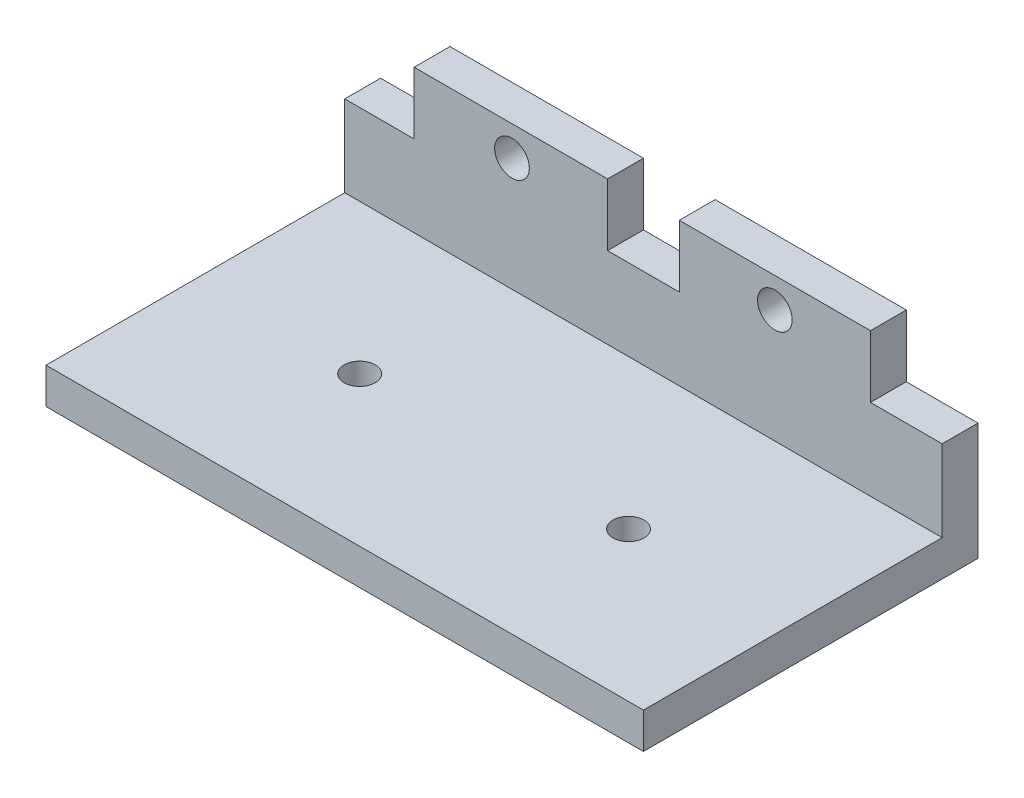
ISO-10303-21;
HEADER;
FILE_DESCRIPTION(('STEP AP214'),'2;1');
FILE_NAME('part.step','',(''),(''),'','','');
FILE_SCHEMA(('AUTOMOTIVE_DESIGN { 1 0 10303 214 1 1 1 1 }'));
ENDSEC;
DATA;
#1=APPLICATION_CONTEXT('core data for automotive mechanical design processes');
#2=APPLICATION_PROTOCOL_DEFINITION('international standard','automotive_design',2000,#1);
#3=PRODUCT_CONTEXT('',#1,'mechanical');
#4=PRODUCT('Part','Part','',(#3));
#5=PRODUCT_RELATED_PRODUCT_CATEGORY('part','',(#4));
#6=PRODUCT_DEFINITION_FORMATION('','',#4);
#7=PRODUCT_DEFINITION_CONTEXT('part definition',#1,'design');
#8=PRODUCT_DEFINITION('design','',#6,#7);
#9=PRODUCT_DEFINITION_SHAPE('','',#8);
#10=(LENGTH_UNIT() NAMED_UNIT(*) SI_UNIT(.MILLI.,.METRE.));
#11=(NAMED_UNIT(*) PLANE_ANGLE_UNIT() SI_UNIT($,.RADIAN.));
#12=(NAMED_UNIT(*) SI_UNIT($,.STERADIAN.) SOLID_ANGLE_UNIT());
#13=UNCERTAINTY_MEASURE_WITH_UNIT(LENGTH_MEASURE(1.E-05),#10,'distance_accuracy_value','');
#14=(GEOMETRIC_REPRESENTATION_CONTEXT(3) GLOBAL_UNCERTAINTY_ASSIGNED_CONTEXT((#13)) GLOBAL_UNIT_ASSIGNED_CONTEXT((#10,
#11,#12)) REPRESENTATION_CONTEXT('',''));
#15=CARTESIAN_POINT('',(0.,0.,0.));
#16=DIRECTION('',(0.,0.,1.));
#17=DIRECTION('',(1.,0.,0.));
#18=AXIS2_PLACEMENT_3D('',#15,#16,#17);
#19=CARTESIAN_POINT('',(0.,15.,0.));
#20=DIRECTION('',(0.,1.,0.));
#21=DIRECTION('',(0.,0.,1.));
#22=AXIS2_PLACEMENT_3D('',#19,#20,#21);
#23=PLANE('',#22);
#24=DIRECTION('',(0.,0.,-1.));
#25=VECTOR('',#24,1.);
#26=CARTESIAN_POINT('',(19.,15.,-11.));
#27=LINE('',#26,#25);
#28=CARTESIAN_POINT('',(19.,15.,-11.));
#29=VERTEX_POINT('',#28);
#30=CARTESIAN_POINT('',(19.,15.,-14.));
#31=VERTEX_POINT('',#30);
#32=EDGE_CURVE('E259',#29,#31,#27,.T.);
#33=ORIENTED_EDGE('',*,*,#32,.T.);
#34=DIRECTION('',(-1.,0.,0.));
#35=VECTOR('',#34,1.);
#36=CARTESIAN_POINT('',(-25.,15.,-14.));
#37=LINE('',#36,#35);
#38=CARTESIAN_POINT('',(3.,15.,-14.));
#39=VERTEX_POINT('',#38);
#40=EDGE_CURVE('E173',#31,#39,#37,.T.);
#41=ORIENTED_EDGE('',*,*,#40,.T.);
#42=DIRECTION('',(0.,0.,-1.));
#43=VECTOR('',#42,1.);
#44=CARTESIAN_POINT('',(3.,15.,-11.));
#45=LINE('',#44,#43);
#46=CARTESIAN_POINT('',(3.,15.,-11.));
#47=VERTEX_POINT('',#46);
#48=EDGE_CURVE('E300',#47,#39,#45,.T.);
#49=ORIENTED_EDGE('',*,*,#48,.F.);
#50=DIRECTION('',(1.,0.,0.));
#51=VECTOR('',#50,1.);
#52=CARTESIAN_POINT('',(-25.,15.,-11.));
#53=LINE('',#52,#51);
#54=EDGE_CURVE('E260',#47,#29,#53,.T.);
#55=ORIENTED_EDGE('',*,*,#54,.T.);
#56=EDGE_LOOP('',(#33,#41,#49,#55));
#57=FACE_BOUND('',#56,.T.);
#58=ADVANCED_FACE('F45',(#57),#23,.T.);
#59=CARTESIAN_POINT('',(25.,3.,-14.));
#60=DIRECTION('',(-1.,0.,0.));
#61=DIRECTION('',(0.,0.,1.));
#62=AXIS2_PLACEMENT_3D('',#59,#60,#61);
#63=PLANE('',#62);
#64=DIRECTION('',(0.,-1.,0.));
#65=VECTOR('',#64,1.);
#66=CARTESIAN_POINT('',(25.,3.,-14.));
#67=LINE('',#66,#65);
#68=CARTESIAN_POINT('',(25.,9.8,-14.));
#69=VERTEX_POINT('',#68);
#70=CARTESIAN_POINT('',(25.,0.,-14.));
#71=VERTEX_POINT('',#70);
#72=EDGE_CURVE('E11',#69,#71,#67,.T.);
#73=ORIENTED_EDGE('',*,*,#72,.F.);
#74=DIRECTION('',(0.,0.,-1.));
#75=VECTOR('',#74,1.);
#76=CARTESIAN_POINT('',(25.,9.8,-11.));
#77=LINE('',#76,#75);
#78=CARTESIAN_POINT('',(25.,9.8,-11.));
#79=VERTEX_POINT('',#78);
#80=EDGE_CURVE('E149',#79,#69,#77,.T.);
#81=ORIENTED_EDGE('',*,*,#80,.F.);
#82=DIRECTION('',(0.,-1.,0.));
#83=VECTOR('',#82,1.);
#84=CARTESIAN_POINT('',(25.,15.,-11.));
#85=LINE('',#84,#83);
#86=CARTESIAN_POINT('',(25.,3.,-11.));
#87=VERTEX_POINT('',#86);
#88=EDGE_CURVE('E162',#79,#87,#85,.T.);
#89=ORIENTED_EDGE('',*,*,#88,.T.);
#90=DIRECTION('',(0.,0.,-1.));
#91=VECTOR('',#90,1.);
#92=CARTESIAN_POINT('',(25.,3.,-14.));
#93=LINE('',#92,#91);
#94=CARTESIAN_POINT('',(25.,3.,14.));
#95=VERTEX_POINT('',#94);
#96=EDGE_CURVE('E184',#95,#87,#93,.T.);
#97=ORIENTED_EDGE('',*,*,#96,.F.);
#98=DIRECTION('',(0.,-1.,0.));
#99=VECTOR('',#98,1.);
#100=CARTESIAN_POINT('',(25.,3.,14.));
#101=LINE('',#100,#99);
#102=CARTESIAN_POINT('',(25.,0.,14.));
#103=VERTEX_POINT('',#102);
#104=EDGE_CURVE('E194',#95,#103,#101,.T.);
#105=ORIENTED_EDGE('',*,*,#104,.T.);
#106=DIRECTION('',(0.,0.,-1.));
#107=VECTOR('',#106,1.);
#108=CARTESIAN_POINT('',(25.,0.,-14.));
#109=LINE('',#108,#107);
#110=EDGE_CURVE('E177',#103,#71,#109,.T.);
#111=ORIENTED_EDGE('',*,*,#110,.T.);
#112=EDGE_LOOP('',(#73,#81,#89,#97,#105,#111));
#113=FACE_BOUND('',#112,.T.);
#114=ADVANCED_FACE('F47',(#113),#63,.F.);
#115=CARTESIAN_POINT('',(-25.,3.,-14.));
#116=DIRECTION('',(0.,0.,1.));
#117=DIRECTION('',(1.,0.,0.));
#118=AXIS2_PLACEMENT_3D('',#115,#116,#117);
#119=PLANE('',#118);
#120=CARTESIAN_POINT('',(11.,12.5,-14.));
#121=DIRECTION('',(0.,0.,-1.));
#122=DIRECTION('',(-1.,0.,0.));
#123=AXIS2_PLACEMENT_3D('',#120,#121,#122);
#124=CIRCLE('',#123,1.45);
#125=CARTESIAN_POINT('',(9.55,12.5,-14.));
#126=VERTEX_POINT('',#125);
#127=EDGE_CURVE('E387',#126,#126,#124,.T.);
#128=ORIENTED_EDGE('',*,*,#127,.F.);
#129=EDGE_LOOP('',(#128));
#130=FACE_BOUND('',#129,.T.);
#131=CARTESIAN_POINT('',(-11.,12.5,-14.));
#132=DIRECTION('',(0.,0.,-1.));
#133=DIRECTION('',(1.,0.,0.));
#134=AXIS2_PLACEMENT_3D('',#131,#132,#133);
#135=CIRCLE('',#134,1.45);
#136=CARTESIAN_POINT('',(-9.55,12.5,-14.));
#137=VERTEX_POINT('',#136);
#138=EDGE_CURVE('E390',#137,#137,#135,.T.);
#139=ORIENTED_EDGE('',*,*,#138,.F.);
#140=EDGE_LOOP('',(#139));
#141=FACE_BOUND('',#140,.T.);
#142=ORIENTED_EDGE('',*,*,#40,.F.);
#143=DIRECTION('',(0.,1.,0.));
#144=VECTOR('',#143,1.);
#145=CARTESIAN_POINT('',(19.,15.,-14.));
#146=LINE('',#145,#144);
#147=CARTESIAN_POINT('',(19.,9.8,-14.));
#148=VERTEX_POINT('',#147);
#149=EDGE_CURVE('E69',#148,#31,#146,.T.);
#150=ORIENTED_EDGE('',*,*,#149,.F.);
#151=DIRECTION('',(-1.,0.,0.));
#152=VECTOR('',#151,1.);
#153=CARTESIAN_POINT('',(25.,9.8,-14.));
#154=LINE('',#153,#152);
#155=EDGE_CURVE('E320',#69,#148,#154,.T.);
#156=ORIENTED_EDGE('',*,*,#155,.F.);
#157=ORIENTED_EDGE('',*,*,#72,.T.);
#158=DIRECTION('',(-1.,0.,0.));
#159=VECTOR('',#158,1.);
#160=CARTESIAN_POINT('',(-25.,0.,-14.));
#161=LINE('',#160,#159);
#162=CARTESIAN_POINT('',(-25.,0.,-14.));
#163=VERTEX_POINT('',#162);
#164=EDGE_CURVE('E197',#71,#163,#161,.T.);
#165=ORIENTED_EDGE('',*,*,#164,.T.);
#166=DIRECTION('',(0.,-1.,0.));
#167=VECTOR('',#166,1.);
#168=CARTESIAN_POINT('',(-25.,3.,-14.));
#169=LINE('',#168,#167);
#170=CARTESIAN_POINT('',(-25.,9.8,-14.));
#171=VERTEX_POINT('',#170);
#172=EDGE_CURVE('E54',#171,#163,#169,.T.);
#173=ORIENTED_EDGE('',*,*,#172,.F.);
#174=DIRECTION('',(-1.,0.,0.));
#175=VECTOR('',#174,1.);
#176=CARTESIAN_POINT('',(-25.191038301225,9.8,-14.));
#177=LINE('',#176,#175);
#178=CARTESIAN_POINT('',(-19.191038301225,9.8,-14.));
#179=VERTEX_POINT('',#178);
#180=EDGE_CURVE('E249',#179,#171,#177,.T.);
#181=ORIENTED_EDGE('',*,*,#180,.F.);
#182=DIRECTION('',(0.,-1.,0.));
#183=VECTOR('',#182,1.);
#184=CARTESIAN_POINT('',(-19.191038301225,15.,-14.));
#185=LINE('',#184,#183);
#186=CARTESIAN_POINT('',(-19.191038301225,15.,-14.));
#187=VERTEX_POINT('',#186);
#188=EDGE_CURVE('E254',#187,#179,#185,.T.);
#189=ORIENTED_EDGE('',*,*,#188,.F.);
#190=CARTESIAN_POINT('',(-3.,15.,-14.));
#191=VERTEX_POINT('',#190);
#192=EDGE_CURVE('E180',#191,#187,#37,.T.);
#193=ORIENTED_EDGE('',*,*,#192,.F.);
#194=DIRECTION('',(0.,1.,0.));
#195=VECTOR('',#194,1.);
#196=CARTESIAN_POINT('',(-3.,15.,-14.));
#197=LINE('',#196,#195);
#198=CARTESIAN_POINT('',(-3.,9.8,-14.));
#199=VERTEX_POINT('',#198);
#200=EDGE_CURVE('E61',#199,#191,#197,.T.);
#201=ORIENTED_EDGE('',*,*,#200,.F.);
#202=DIRECTION('',(-1.,0.,0.));
#203=VECTOR('',#202,1.);
#204=CARTESIAN_POINT('',(3.,9.8,-14.));
#205=LINE('',#204,#203);
#206=CARTESIAN_POINT('',(3.,9.8,-14.));
#207=VERTEX_POINT('',#206);
#208=EDGE_CURVE('E314',#207,#199,#205,.T.);
#209=ORIENTED_EDGE('',*,*,#208,.F.);
#210=DIRECTION('',(0.,-1.,0.));
#211=VECTOR('',#210,1.);
#212=CARTESIAN_POINT('',(3.,15.,-14.));
#213=LINE('',#212,#211);
#214=EDGE_CURVE('E290',#39,#207,#213,.T.);
#215=ORIENTED_EDGE('',*,*,#214,.F.);
#216=EDGE_LOOP('',(#142,#150,#156,#157,#165,#173,#181,#189,#193,#201,#209,#215));
#217=FACE_BOUND('',#216,.T.);
#218=ADVANCED_FACE('F225',(#130,#141,#217),#119,.F.);
#219=CARTESIAN_POINT('',(-25.,3.,-14.));
#220=DIRECTION('',(1.,0.,0.));
#221=DIRECTION('',(0.,0.,-1.));
#222=AXIS2_PLACEMENT_3D('',#219,#220,#221);
#223=PLANE('',#222);
#224=DIRECTION('',(0.,-1.,0.));
#225=VECTOR('',#224,1.);
#226=CARTESIAN_POINT('',(-25.,15.,-11.));
#227=LINE('',#226,#225);
#228=CARTESIAN_POINT('',(-25.,9.8,-11.));
#229=VERTEX_POINT('',#228);
#230=CARTESIAN_POINT('',(-25.,3.,-11.));
#231=VERTEX_POINT('',#230);
#232=EDGE_CURVE('E172',#229,#231,#227,.T.);
#233=ORIENTED_EDGE('',*,*,#232,.F.);
#234=DIRECTION('',(0.,0.,-1.));
#235=VECTOR('',#234,1.);
#236=CARTESIAN_POINT('',(-25.,9.8,-14.));
#237=LINE('',#236,#235);
#238=EDGE_CURVE('E220',#229,#171,#237,.T.);
#239=ORIENTED_EDGE('',*,*,#238,.T.);
#240=ORIENTED_EDGE('',*,*,#172,.T.);
#241=DIRECTION('',(0.,0.,1.));
#242=VECTOR('',#241,1.);
#243=CARTESIAN_POINT('',(-25.,0.,-14.));
#244=LINE('',#243,#242);
#245=CARTESIAN_POINT('',(-25.,0.,14.));
#246=VERTEX_POINT('',#245);
#247=EDGE_CURVE('E201',#163,#246,#244,.T.);
#248=ORIENTED_EDGE('',*,*,#247,.T.);
#249=DIRECTION('',(0.,-1.,0.));
#250=VECTOR('',#249,1.);
#251=CARTESIAN_POINT('',(-25.,3.,14.));
#252=LINE('',#251,#250);
#253=CARTESIAN_POINT('',(-25.,3.,14.));
#254=VERTEX_POINT('',#253);
#255=EDGE_CURVE('E209',#254,#246,#252,.T.);
#256=ORIENTED_EDGE('',*,*,#255,.F.);
#257=DIRECTION('',(0.,0.,1.));
#258=VECTOR('',#257,1.);
#259=CARTESIAN_POINT('',(-25.,3.,-14.));
#260=LINE('',#259,#258);
#261=EDGE_CURVE('E187',#231,#254,#260,.T.);
#262=ORIENTED_EDGE('',*,*,#261,.F.);
#263=EDGE_LOOP('',(#233,#239,#240,#248,#256,#262));
#264=FACE_BOUND('',#263,.T.);
#265=ADVANCED_FACE('F217',(#264),#223,.F.);
#266=CARTESIAN_POINT('',(-25.,3.,14.));
#267=DIRECTION('',(0.,0.,-1.));
#268=DIRECTION('',(-1.,0.,0.));
#269=AXIS2_PLACEMENT_3D('',#266,#267,#268);
#270=PLANE('',#269);
#271=DIRECTION('',(1.,0.,0.));
#272=VECTOR('',#271,1.);
#273=CARTESIAN_POINT('',(-25.,0.,14.));
#274=LINE('',#273,#272);
#275=EDGE_CURVE('E188',#246,#103,#274,.T.);
#276=ORIENTED_EDGE('',*,*,#275,.T.);
#277=ORIENTED_EDGE('',*,*,#104,.F.);
#278=DIRECTION('',(1.,0.,0.));
#279=VECTOR('',#278,1.);
#280=CARTESIAN_POINT('',(-25.,3.,14.));
#281=LINE('',#280,#279);
#282=EDGE_CURVE('E191',#254,#95,#281,.T.);
#283=ORIENTED_EDGE('',*,*,#282,.F.);
#284=ORIENTED_EDGE('',*,*,#255,.T.);
#285=EDGE_LOOP('',(#276,#277,#283,#284));
#286=FACE_BOUND('',#285,.T.);
#287=ADVANCED_FACE('F232',(#286),#270,.F.);
#288=CARTESIAN_POINT('',(0.,3.,0.));
#289=DIRECTION('',(0.,1.,0.));
#290=DIRECTION('',(0.,0.,1.));
#291=AXIS2_PLACEMENT_3D('',#288,#289,#290);
#292=PLANE('',#291);
#293=CARTESIAN_POINT('',(-11.25,3.,1.5));
#294=DIRECTION('',(0.,-1.,0.));
#295=DIRECTION('',(0.,0.,-1.));
#296=AXIS2_PLACEMENT_3D('',#293,#294,#295);
#297=CIRCLE('',#296,1.3);
#298=CARTESIAN_POINT('',(-11.25,3.,0.200000000000002));
#299=VERTEX_POINT('',#298);
#300=EDGE_CURVE('E296',#299,#299,#297,.T.);
#301=ORIENTED_EDGE('',*,*,#300,.T.);
#302=EDGE_LOOP('',(#301));
#303=FACE_BOUND('',#302,.T.);
#304=CARTESIAN_POINT('',(11.25,3.,1.5));
#305=DIRECTION('',(0.,-1.,0.));
#306=DIRECTION('',(0.,0.,1.));
#307=AXIS2_PLACEMENT_3D('',#304,#305,#306);
#308=CIRCLE('',#307,1.3);
#309=CARTESIAN_POINT('',(11.25,3.,2.8));
#310=VERTEX_POINT('',#309);
#311=EDGE_CURVE('E414',#310,#310,#308,.T.);
#312=ORIENTED_EDGE('',*,*,#311,.T.);
#313=EDGE_LOOP('',(#312));
#314=FACE_BOUND('',#313,.T.);
#315=DIRECTION('',(1.,0.,0.));
#316=VECTOR('',#315,1.);
#317=CARTESIAN_POINT('',(-25.,3.,-11.));
#318=LINE('',#317,#316);
#319=EDGE_CURVE('E170',#231,#87,#318,.T.);
#320=ORIENTED_EDGE('',*,*,#319,.F.);
#321=ORIENTED_EDGE('',*,*,#261,.T.);
#322=ORIENTED_EDGE('',*,*,#282,.T.);
#323=ORIENTED_EDGE('',*,*,#96,.T.);
#324=EDGE_LOOP('',(#320,#321,#322,#323));
#325=FACE_BOUND('',#324,.T.);
#326=ADVANCED_FACE('F235',(#303,#314,#325),#292,.T.);
#327=CARTESIAN_POINT('',(0.,0.,0.));
#328=DIRECTION('',(0.,1.,0.));
#329=DIRECTION('',(0.,0.,1.));
#330=AXIS2_PLACEMENT_3D('',#327,#328,#329);
#331=PLANE('',#330);
#332=CARTESIAN_POINT('',(-11.25,0.,1.5));
#333=DIRECTION('',(0.,-1.,0.));
#334=DIRECTION('',(0.,0.,-1.));
#335=AXIS2_PLACEMENT_3D('',#332,#333,#334);
#336=CIRCLE('',#335,1.3);
#337=CARTESIAN_POINT('',(-11.25,0.,0.200000000000002));
#338=VERTEX_POINT('',#337);
#339=EDGE_CURVE('E406',#338,#338,#336,.T.);
#340=ORIENTED_EDGE('',*,*,#339,.F.);
#341=EDGE_LOOP('',(#340));
#342=FACE_BOUND('',#341,.T.);
#343=CARTESIAN_POINT('',(11.25,0.,1.5));
#344=DIRECTION('',(0.,-1.,0.));
#345=DIRECTION('',(0.,0.,1.));
#346=AXIS2_PLACEMENT_3D('',#343,#344,#345);
#347=CIRCLE('',#346,1.3);
#348=CARTESIAN_POINT('',(11.25,0.,2.8));
#349=VERTEX_POINT('',#348);
#350=EDGE_CURVE('E410',#349,#349,#347,.T.);
#351=ORIENTED_EDGE('',*,*,#350,.F.);
#352=EDGE_LOOP('',(#351));
#353=FACE_BOUND('',#352,.T.);
#354=ORIENTED_EDGE('',*,*,#110,.F.);
#355=ORIENTED_EDGE('',*,*,#275,.F.);
#356=ORIENTED_EDGE('',*,*,#247,.F.);
#357=ORIENTED_EDGE('',*,*,#164,.F.);
#358=EDGE_LOOP('',(#354,#355,#356,#357));
#359=FACE_BOUND('',#358,.T.);
#360=ADVANCED_FACE('F229',(#342,#353,#359),#331,.F.);
#361=CARTESIAN_POINT('',(-25.,15.,-11.));
#362=DIRECTION('',(0.,0.,-1.));
#363=DIRECTION('',(-1.,0.,0.));
#364=AXIS2_PLACEMENT_3D('',#361,#362,#363);
#365=PLANE('',#364);
#366=CARTESIAN_POINT('',(11.,12.5,-11.));
#367=DIRECTION('',(0.,0.,-1.));
#368=DIRECTION('',(-1.,0.,0.));
#369=AXIS2_PLACEMENT_3D('',#366,#367,#368);
#370=CIRCLE('',#369,1.45);
#371=CARTESIAN_POINT('',(9.55,12.5,-11.));
#372=VERTEX_POINT('',#371);
#373=EDGE_CURVE('E397',#372,#372,#370,.T.);
#374=ORIENTED_EDGE('',*,*,#373,.T.);
#375=EDGE_LOOP('',(#374));
#376=FACE_BOUND('',#375,.T.);
#377=CARTESIAN_POINT('',(-11.,12.5,-11.));
#378=DIRECTION('',(0.,0.,-1.));
#379=DIRECTION('',(1.,0.,0.));
#380=AXIS2_PLACEMENT_3D('',#377,#378,#379);
#381=CIRCLE('',#380,1.45);
#382=CARTESIAN_POINT('',(-9.55,12.5,-11.));
#383=VERTEX_POINT('',#382);
#384=EDGE_CURVE('E393',#383,#383,#381,.T.);
#385=ORIENTED_EDGE('',*,*,#384,.T.);
#386=EDGE_LOOP('',(#385));
#387=FACE_BOUND('',#386,.T.);
#388=DIRECTION('',(-1.,0.,0.));
#389=VECTOR('',#388,1.);
#390=CARTESIAN_POINT('',(25.,9.8,-11.));
#391=LINE('',#390,#389);
#392=CARTESIAN_POINT('',(19.,9.8,-11.));
#393=VERTEX_POINT('',#392);
#394=EDGE_CURVE('E145',#79,#393,#391,.T.);
#395=ORIENTED_EDGE('',*,*,#394,.T.);
#396=DIRECTION('',(0.,1.,0.));
#397=VECTOR('',#396,1.);
#398=CARTESIAN_POINT('',(19.,15.,-11.));
#399=LINE('',#398,#397);
#400=EDGE_CURVE('E157',#393,#29,#399,.T.);
#401=ORIENTED_EDGE('',*,*,#400,.T.);
#402=ORIENTED_EDGE('',*,*,#54,.F.);
#403=DIRECTION('',(0.,-1.,0.));
#404=VECTOR('',#403,1.);
#405=CARTESIAN_POINT('',(3.,15.,-11.));
#406=LINE('',#405,#404);
#407=CARTESIAN_POINT('',(3.,9.8,-11.));
#408=VERTEX_POINT('',#407);
#409=EDGE_CURVE('E285',#47,#408,#406,.T.);
#410=ORIENTED_EDGE('',*,*,#409,.T.);
#411=DIRECTION('',(-1.,0.,0.));
#412=VECTOR('',#411,1.);
#413=CARTESIAN_POINT('',(3.,9.8,-11.));
#414=LINE('',#413,#412);
#415=CARTESIAN_POINT('',(-3.,9.8,-11.));
#416=VERTEX_POINT('',#415);
#417=EDGE_CURVE('E279',#408,#416,#414,.T.);
#418=ORIENTED_EDGE('',*,*,#417,.T.);
#419=DIRECTION('',(0.,1.,0.));
#420=VECTOR('',#419,1.);
#421=CARTESIAN_POINT('',(-3.,15.,-11.));
#422=LINE('',#421,#420);
#423=CARTESIAN_POINT('',(-3.,15.,-11.));
#424=VERTEX_POINT('',#423);
#425=EDGE_CURVE('E276',#416,#424,#422,.T.);
#426=ORIENTED_EDGE('',*,*,#425,.T.);
#427=CARTESIAN_POINT('',(-19.191038301225,15.,-11.));
#428=VERTEX_POINT('',#427);
#429=EDGE_CURVE('E263',#428,#424,#53,.T.);
#430=ORIENTED_EDGE('',*,*,#429,.F.);
#431=DIRECTION('',(0.,-1.,0.));
#432=VECTOR('',#431,1.);
#433=CARTESIAN_POINT('',(-19.191038301225,15.,-11.));
#434=LINE('',#433,#432);
#435=CARTESIAN_POINT('',(-19.191038301225,9.8,-11.));
#436=VERTEX_POINT('',#435);
#437=EDGE_CURVE('E242',#428,#436,#434,.T.);
#438=ORIENTED_EDGE('',*,*,#437,.T.);
#439=DIRECTION('',(-1.,0.,0.));
#440=VECTOR('',#439,1.);
#441=CARTESIAN_POINT('',(-25.191038301225,9.8,-11.));
#442=LINE('',#441,#440);
#443=EDGE_CURVE('E240',#436,#229,#442,.T.);
#444=ORIENTED_EDGE('',*,*,#443,.T.);
#445=ORIENTED_EDGE('',*,*,#232,.T.);
#446=ORIENTED_EDGE('',*,*,#319,.T.);
#447=ORIENTED_EDGE('',*,*,#88,.F.);
#448=EDGE_LOOP('',(#395,#401,#402,#410,#418,#426,#430,#438,#444,#445,#446,#447));
#449=FACE_BOUND('',#448,.T.);
#450=ADVANCED_FACE('F168',(#376,#387,#449),#365,.F.);
#451=DIRECTION('',(0.,0.,-1.));
#452=VECTOR('',#451,1.);
#453=CARTESIAN_POINT('',(-3.,15.,-11.));
#454=LINE('',#453,#452);
#455=EDGE_CURVE('E272',#424,#191,#454,.T.);
#456=ORIENTED_EDGE('',*,*,#455,.T.);
#457=ORIENTED_EDGE('',*,*,#192,.T.);
#458=DIRECTION('',(0.,0.,-1.));
#459=VECTOR('',#458,1.);
#460=CARTESIAN_POINT('',(-19.191038301225,15.,-11.));
#461=LINE('',#460,#459);
#462=EDGE_CURVE('E245',#428,#187,#461,.T.);
#463=ORIENTED_EDGE('',*,*,#462,.F.);
#464=ORIENTED_EDGE('',*,*,#429,.T.);
#465=EDGE_LOOP('',(#456,#457,#463,#464));
#466=FACE_BOUND('',#465,.T.);
#467=ADVANCED_FACE('F271',(#466),#23,.T.);
#468=CARTESIAN_POINT('',(-25.191038301225,9.8,-11.));
#469=DIRECTION('',(0.,-1.,0.));
#470=DIRECTION('',(0.,0.,-1.));
#471=AXIS2_PLACEMENT_3D('',#468,#469,#470);
#472=PLANE('',#471);
#473=ORIENTED_EDGE('',*,*,#443,.F.);
#474=DIRECTION('',(0.,0.,-1.));
#475=VECTOR('',#474,1.);
#476=CARTESIAN_POINT('',(-19.191038301225,9.8,-11.));
#477=LINE('',#476,#475);
#478=EDGE_CURVE('E251',#436,#179,#477,.T.);
#479=ORIENTED_EDGE('',*,*,#478,.T.);
#480=ORIENTED_EDGE('',*,*,#180,.T.);
#481=ORIENTED_EDGE('',*,*,#238,.F.);
#482=EDGE_LOOP('',(#473,#479,#480,#481));
#483=FACE_BOUND('',#482,.T.);
#484=ADVANCED_FACE('F358',(#483),#472,.F.);
#485=CARTESIAN_POINT('',(-19.191038301225,15.,-11.));
#486=DIRECTION('',(1.,0.,0.));
#487=DIRECTION('',(0.,0.,-1.));
#488=AXIS2_PLACEMENT_3D('',#485,#486,#487);
#489=PLANE('',#488);
#490=ORIENTED_EDGE('',*,*,#188,.T.);
#491=ORIENTED_EDGE('',*,*,#478,.F.);
#492=ORIENTED_EDGE('',*,*,#437,.F.);
#493=ORIENTED_EDGE('',*,*,#462,.T.);
#494=EDGE_LOOP('',(#490,#491,#492,#493));
#495=FACE_BOUND('',#494,.T.);
#496=ADVANCED_FACE('F363',(#495),#489,.F.);
#497=CARTESIAN_POINT('',(3.,15.,-11.));
#498=DIRECTION('',(1.,0.,0.));
#499=DIRECTION('',(0.,0.,-1.));
#500=AXIS2_PLACEMENT_3D('',#497,#498,#499);
#501=PLANE('',#500);
#502=ORIENTED_EDGE('',*,*,#214,.T.);
#503=DIRECTION('',(0.,0.,-1.));
#504=VECTOR('',#503,1.);
#505=CARTESIAN_POINT('',(3.,9.8,-11.));
#506=LINE('',#505,#504);
#507=EDGE_CURVE('E281',#408,#207,#506,.T.);
#508=ORIENTED_EDGE('',*,*,#507,.F.);
#509=ORIENTED_EDGE('',*,*,#409,.F.);
#510=ORIENTED_EDGE('',*,*,#48,.T.);
#511=EDGE_LOOP('',(#502,#508,#509,#510));
#512=FACE_BOUND('',#511,.T.);
#513=ADVANCED_FACE('F334',(#512),#501,.F.);
#514=CARTESIAN_POINT('',(-3.,15.,-11.));
#515=DIRECTION('',(-1.,0.,0.));
#516=DIRECTION('',(0.,0.,1.));
#517=AXIS2_PLACEMENT_3D('',#514,#515,#516);
#518=PLANE('',#517);
#519=ORIENTED_EDGE('',*,*,#200,.T.);
#520=ORIENTED_EDGE('',*,*,#455,.F.);
#521=ORIENTED_EDGE('',*,*,#425,.F.);
#522=DIRECTION('',(0.,0.,-1.));
#523=VECTOR('',#522,1.);
#524=CARTESIAN_POINT('',(-3.,9.8,-11.));
#525=LINE('',#524,#523);
#526=EDGE_CURVE('E287',#416,#199,#525,.T.);
#527=ORIENTED_EDGE('',*,*,#526,.T.);
#528=EDGE_LOOP('',(#519,#520,#521,#527));
#529=FACE_BOUND('',#528,.T.);
#530=ADVANCED_FACE('F331',(#529),#518,.F.);
#531=CARTESIAN_POINT('',(3.,9.8,-11.));
#532=DIRECTION('',(0.,-1.,0.));
#533=DIRECTION('',(0.,0.,-1.));
#534=AXIS2_PLACEMENT_3D('',#531,#532,#533);
#535=PLANE('',#534);
#536=ORIENTED_EDGE('',*,*,#208,.T.);
#537=ORIENTED_EDGE('',*,*,#526,.F.);
#538=ORIENTED_EDGE('',*,*,#417,.F.);
#539=ORIENTED_EDGE('',*,*,#507,.T.);
#540=EDGE_LOOP('',(#536,#537,#538,#539));
#541=FACE_BOUND('',#540,.T.);
#542=ADVANCED_FACE('F332',(#541),#535,.F.);
#543=CARTESIAN_POINT('',(19.,15.,-11.));
#544=DIRECTION('',(-1.,0.,0.));
#545=DIRECTION('',(0.,0.,1.));
#546=AXIS2_PLACEMENT_3D('',#543,#544,#545);
#547=PLANE('',#546);
#548=ORIENTED_EDGE('',*,*,#149,.T.);
#549=ORIENTED_EDGE('',*,*,#32,.F.);
#550=ORIENTED_EDGE('',*,*,#400,.F.);
#551=DIRECTION('',(0.,0.,-1.));
#552=VECTOR('',#551,1.);
#553=CARTESIAN_POINT('',(19.,9.8,-11.));
#554=LINE('',#553,#552);
#555=EDGE_CURVE('E151',#393,#148,#554,.T.);
#556=ORIENTED_EDGE('',*,*,#555,.T.);
#557=EDGE_LOOP('',(#548,#549,#550,#556));
#558=FACE_BOUND('',#557,.T.);
#559=ADVANCED_FACE('F336',(#558),#547,.F.);
#560=CARTESIAN_POINT('',(25.,9.8,-11.));
#561=DIRECTION('',(0.,-1.,0.));
#562=DIRECTION('',(0.,0.,-1.));
#563=AXIS2_PLACEMENT_3D('',#560,#561,#562);
#564=PLANE('',#563);
#565=ORIENTED_EDGE('',*,*,#155,.T.);
#566=ORIENTED_EDGE('',*,*,#555,.F.);
#567=ORIENTED_EDGE('',*,*,#394,.F.);
#568=ORIENTED_EDGE('',*,*,#80,.T.);
#569=EDGE_LOOP('',(#565,#566,#567,#568));
#570=FACE_BOUND('',#569,.T.);
#571=ADVANCED_FACE('F148',(#570),#564,.F.);
#572=CARTESIAN_POINT('',(11.25,3.,1.5));
#573=DIRECTION('',(0.,-1.,0.));
#574=DIRECTION('',(0.,0.,-1.));
#575=AXIS2_PLACEMENT_3D('',#572,#573,#574);
#576=CYLINDRICAL_SURFACE('',#575,1.3);
#577=ORIENTED_EDGE('',*,*,#311,.F.);
#578=EDGE_LOOP('',(#577));
#579=FACE_BOUND('',#578,.T.);
#580=ORIENTED_EDGE('',*,*,#350,.T.);
#581=EDGE_LOOP('',(#580));
#582=FACE_BOUND('',#581,.T.);
#583=ADVANCED_FACE('F345',(#579,#582),#576,.F.);
#584=CARTESIAN_POINT('',(-11.25,3.,1.5));
#585=DIRECTION('',(0.,-1.,0.));
#586=DIRECTION('',(0.,0.,-1.));
#587=AXIS2_PLACEMENT_3D('',#584,#585,#586);
#588=CYLINDRICAL_SURFACE('',#587,1.3);
#589=ORIENTED_EDGE('',*,*,#300,.F.);
#590=EDGE_LOOP('',(#589));
#591=FACE_BOUND('',#590,.T.);
#592=ORIENTED_EDGE('',*,*,#339,.T.);
#593=EDGE_LOOP('',(#592));
#594=FACE_BOUND('',#593,.T.);
#595=ADVANCED_FACE('F429',(#591,#594),#588,.F.);
#596=CARTESIAN_POINT('',(-11.,12.5,-11.));
#597=DIRECTION('',(0.,0.,-1.));
#598=DIRECTION('',(-1.,0.,0.));
#599=AXIS2_PLACEMENT_3D('',#596,#597,#598);
#600=CYLINDRICAL_SURFACE('',#599,1.45);
#601=ORIENTED_EDGE('',*,*,#384,.F.);
#602=EDGE_LOOP('',(#601));
#603=FACE_BOUND('',#602,.T.);
#604=ORIENTED_EDGE('',*,*,#138,.T.);
#605=EDGE_LOOP('',(#604));
#606=FACE_BOUND('',#605,.T.);
#607=ADVANCED_FACE('F425',(#603,#606),#600,.F.);
#608=CARTESIAN_POINT('',(11.,12.5,-11.));
#609=DIRECTION('',(0.,0.,-1.));
#610=DIRECTION('',(-1.,0.,0.));
#611=AXIS2_PLACEMENT_3D('',#608,#609,#610);
#612=CYLINDRICAL_SURFACE('',#611,1.45);
#613=ORIENTED_EDGE('',*,*,#373,.F.);
#614=EDGE_LOOP('',(#613));
#615=FACE_BOUND('',#614,.T.);
#616=ORIENTED_EDGE('',*,*,#127,.T.);
#617=EDGE_LOOP('',(#616));
#618=FACE_BOUND('',#617,.T.);
#619=ADVANCED_FACE('F422',(#615,#618),#612,.F.);
#620=CLOSED_SHELL('',(#58,#114,#218,#265,#287,#326,#360,#450,#467,#484,#496,#513,#530,#542,#559,
#571,#583,#595,#607,#619));
#621=MANIFOLD_SOLID_BREP('B2',#620);
#622=ADVANCED_BREP_SHAPE_REPRESENTATION('',(#18,#621),#14);
#623=SHAPE_DEFINITION_REPRESENTATION(#9,#622);
ENDSEC;
END-ISO-10303-21;
